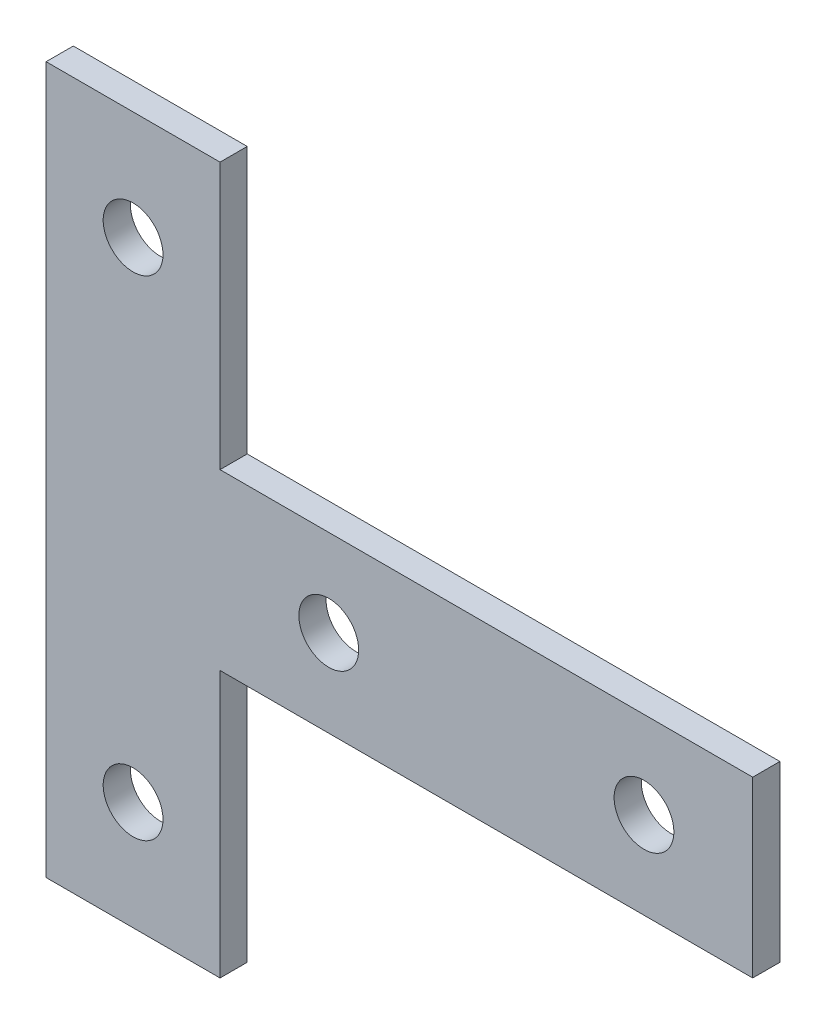
ISO-10303-21;
HEADER;
FILE_DESCRIPTION(('STEP AP214'),'2;1');
FILE_NAME('part.step','',(''),(''),'','','');
FILE_SCHEMA(('AUTOMOTIVE_DESIGN { 1 0 10303 214 1 1 1 1 }'));
ENDSEC;
DATA;
#1=APPLICATION_CONTEXT('core data for automotive mechanical design processes');
#2=APPLICATION_PROTOCOL_DEFINITION('international standard','automotive_design',2000,#1);
#3=PRODUCT_CONTEXT('',#1,'mechanical');
#4=PRODUCT('Part','Part','',(#3));
#5=PRODUCT_RELATED_PRODUCT_CATEGORY('part','',(#4));
#6=PRODUCT_DEFINITION_FORMATION('','',#4);
#7=PRODUCT_DEFINITION_CONTEXT('part definition',#1,'design');
#8=PRODUCT_DEFINITION('design','',#6,#7);
#9=PRODUCT_DEFINITION_SHAPE('','',#8);
#10=(LENGTH_UNIT() NAMED_UNIT(*) SI_UNIT(.MILLI.,.METRE.));
#11=(NAMED_UNIT(*) PLANE_ANGLE_UNIT() SI_UNIT($,.RADIAN.));
#12=(NAMED_UNIT(*) SI_UNIT($,.STERADIAN.) SOLID_ANGLE_UNIT());
#13=UNCERTAINTY_MEASURE_WITH_UNIT(LENGTH_MEASURE(1.E-05),#10,'distance_accuracy_value','');
#14=(GEOMETRIC_REPRESENTATION_CONTEXT(3) GLOBAL_UNCERTAINTY_ASSIGNED_CONTEXT((#13)) GLOBAL_UNIT_ASSIGNED_CONTEXT((#10,
#11,#12)) REPRESENTATION_CONTEXT('',''));
#15=CARTESIAN_POINT('',(0.,0.,0.));
#16=DIRECTION('',(0.,0.,1.));
#17=DIRECTION('',(1.,0.,0.));
#18=AXIS2_PLACEMENT_3D('',#15,#16,#17);
#19=CARTESIAN_POINT('',(0.,0.,2.5));
#20=DIRECTION('',(0.,0.,1.));
#21=DIRECTION('',(1.,0.,0.));
#22=AXIS2_PLACEMENT_3D('',#19,#20,#21);
#23=PLANE('',#22);
#24=CARTESIAN_POINT('',(-14.3167297303139,0.0308345227830586,2.5));
#25=DIRECTION('',(0.,0.,1.));
#26=DIRECTION('',(1.,0.,0.));
#27=AXIS2_PLACEMENT_3D('',#24,#25,#26);
#28=CIRCLE('',#27,2.75);
#29=CARTESIAN_POINT('',(-11.5667297303139,0.0308345227830586,2.5));
#30=VERTEX_POINT('',#29);
#31=EDGE_CURVE('E190',#30,#30,#28,.T.);
#32=ORIENTED_EDGE('',*,*,#31,.F.);
#33=EDGE_LOOP('',(#32));
#34=FACE_BOUND('',#33,.T.);
#35=CARTESIAN_POINT('',(32.6832702696861,22.5308345227831,2.5));
#36=DIRECTION('',(0.,0.,1.));
#37=DIRECTION('',(1.,0.,0.));
#38=AXIS2_PLACEMENT_3D('',#35,#36,#37);
#39=CIRCLE('',#38,2.75);
#40=CARTESIAN_POINT('',(35.4332702696861,22.5308345227831,2.5));
#41=VERTEX_POINT('',#40);
#42=EDGE_CURVE('E136',#41,#41,#39,.T.);
#43=ORIENTED_EDGE('',*,*,#42,.F.);
#44=EDGE_LOOP('',(#43));
#45=FACE_BOUND('',#44,.T.);
#46=DIRECTION('',(-1.,0.,0.));
#47=VECTOR('',#46,1.);
#48=CARTESIAN_POINT('',(-6.31672973031387,55.0308345227831,2.5));
#49=LINE('',#48,#47);
#50=CARTESIAN_POINT('',(-6.31672973031387,55.0308345227831,2.5));
#51=VERTEX_POINT('',#50);
#52=CARTESIAN_POINT('',(-22.3167297303139,55.0308345227831,2.5));
#53=VERTEX_POINT('',#52);
#54=EDGE_CURVE('E147',#51,#53,#49,.T.);
#55=ORIENTED_EDGE('',*,*,#54,.T.);
#56=DIRECTION('',(0.,-1.,0.));
#57=VECTOR('',#56,1.);
#58=CARTESIAN_POINT('',(-22.3167297303139,55.0308345227831,2.5));
#59=LINE('',#58,#57);
#60=CARTESIAN_POINT('',(-22.3167297303139,-9.96916547721694,2.5));
#61=VERTEX_POINT('',#60);
#62=EDGE_CURVE('E95',#53,#61,#59,.T.);
#63=ORIENTED_EDGE('',*,*,#62,.T.);
#64=DIRECTION('',(1.,0.,0.));
#65=VECTOR('',#64,1.);
#66=CARTESIAN_POINT('',(-22.3167297303139,-9.96916547721694,2.5));
#67=LINE('',#66,#65);
#68=CARTESIAN_POINT('',(-6.31672973031387,-9.96916547721694,2.5));
#69=VERTEX_POINT('',#68);
#70=EDGE_CURVE('E162',#61,#69,#67,.T.);
#71=ORIENTED_EDGE('',*,*,#70,.T.);
#72=DIRECTION('',(0.,1.,0.));
#73=VECTOR('',#72,1.);
#74=CARTESIAN_POINT('',(-6.31672973031387,-9.96916547721694,2.5));
#75=LINE('',#74,#73);
#76=CARTESIAN_POINT('',(-6.31672973031387,14.5308345227831,2.5));
#77=VERTEX_POINT('',#76);
#78=EDGE_CURVE('E175',#69,#77,#75,.T.);
#79=ORIENTED_EDGE('',*,*,#78,.T.);
#80=DIRECTION('',(1.,0.,0.));
#81=VECTOR('',#80,1.);
#82=CARTESIAN_POINT('',(-6.31672973031387,14.5308345227831,2.5));
#83=LINE('',#82,#81);
#84=CARTESIAN_POINT('',(42.6832702696861,14.5308345227831,2.5));
#85=VERTEX_POINT('',#84);
#86=EDGE_CURVE('E114',#77,#85,#83,.T.);
#87=ORIENTED_EDGE('',*,*,#86,.T.);
#88=DIRECTION('',(0.,1.,0.));
#89=VECTOR('',#88,1.);
#90=CARTESIAN_POINT('',(42.6832702696861,14.5308345227831,2.5));
#91=LINE('',#90,#89);
#92=CARTESIAN_POINT('',(42.6832702696861,30.5308345227831,2.5));
#93=VERTEX_POINT('',#92);
#94=EDGE_CURVE('E108',#85,#93,#91,.T.);
#95=ORIENTED_EDGE('',*,*,#94,.T.);
#96=DIRECTION('',(-1.,0.,0.));
#97=VECTOR('',#96,1.);
#98=CARTESIAN_POINT('',(42.6832702696861,30.5308345227831,2.5));
#99=LINE('',#98,#97);
#100=CARTESIAN_POINT('',(-6.31672973031387,30.5308345227831,2.5));
#101=VERTEX_POINT('',#100);
#102=EDGE_CURVE('E112',#93,#101,#99,.T.);
#103=ORIENTED_EDGE('',*,*,#102,.T.);
#104=DIRECTION('',(0.,1.,0.));
#105=VECTOR('',#104,1.);
#106=CARTESIAN_POINT('',(-6.31672973031387,30.5308345227831,2.5));
#107=LINE('',#106,#105);
#108=EDGE_CURVE('E52',#101,#51,#107,.T.);
#109=ORIENTED_EDGE('',*,*,#108,.T.);
#110=EDGE_LOOP('',(#55,#63,#71,#79,#87,#95,#103,#109));
#111=FACE_BOUND('',#110,.T.);
#112=CARTESIAN_POINT('',(3.68327026968613,22.5308345227831,2.5));
#113=DIRECTION('',(0.,0.,1.));
#114=DIRECTION('',(1.,0.,0.));
#115=AXIS2_PLACEMENT_3D('',#112,#113,#114);
#116=CIRCLE('',#115,2.75);
#117=CARTESIAN_POINT('',(6.43327026968613,22.5308345227831,2.5));
#118=VERTEX_POINT('',#117);
#119=EDGE_CURVE('E184',#118,#118,#116,.T.);
#120=ORIENTED_EDGE('',*,*,#119,.F.);
#121=EDGE_LOOP('',(#120));
#122=FACE_BOUND('',#121,.T.);
#123=CARTESIAN_POINT('',(-14.3167297303139,45.0308345227831,2.5));
#124=DIRECTION('',(0.,0.,1.));
#125=DIRECTION('',(1.,0.,0.));
#126=AXIS2_PLACEMENT_3D('',#123,#124,#125);
#127=CIRCLE('',#126,2.75);
#128=CARTESIAN_POINT('',(-11.5667297303139,45.0308345227831,2.5));
#129=VERTEX_POINT('',#128);
#130=EDGE_CURVE('E196',#129,#129,#127,.T.);
#131=ORIENTED_EDGE('',*,*,#130,.F.);
#132=EDGE_LOOP('',(#131));
#133=FACE_BOUND('',#132,.T.);
#134=ADVANCED_FACE('F35',(#34,#45,#111,#122,#133),#23,.T.);
#135=CARTESIAN_POINT('',(0.,0.,0.));
#136=DIRECTION('',(0.,0.,1.));
#137=DIRECTION('',(1.,0.,0.));
#138=AXIS2_PLACEMENT_3D('',#135,#136,#137);
#139=PLANE('',#138);
#140=DIRECTION('',(-1.,0.,0.));
#141=VECTOR('',#140,1.);
#142=CARTESIAN_POINT('',(-6.31672973031387,55.0308345227831,0.));
#143=LINE('',#142,#141);
#144=CARTESIAN_POINT('',(-6.31672973031387,55.0308345227831,0.));
#145=VERTEX_POINT('',#144);
#146=CARTESIAN_POINT('',(-22.3167297303139,55.0308345227831,0.));
#147=VERTEX_POINT('',#146);
#148=EDGE_CURVE('E132',#145,#147,#143,.T.);
#149=ORIENTED_EDGE('',*,*,#148,.F.);
#150=DIRECTION('',(0.,1.,0.));
#151=VECTOR('',#150,1.);
#152=CARTESIAN_POINT('',(-6.31672973031387,30.5308345227831,0.));
#153=LINE('',#152,#151);
#154=CARTESIAN_POINT('',(-6.31672973031387,30.5308345227831,0.));
#155=VERTEX_POINT('',#154);
#156=EDGE_CURVE('E87',#155,#145,#153,.T.);
#157=ORIENTED_EDGE('',*,*,#156,.F.);
#158=DIRECTION('',(-1.,0.,0.));
#159=VECTOR('',#158,1.);
#160=CARTESIAN_POINT('',(42.6832702696861,30.5308345227831,0.));
#161=LINE('',#160,#159);
#162=CARTESIAN_POINT('',(42.6832702696861,30.5308345227831,0.));
#163=VERTEX_POINT('',#162);
#164=EDGE_CURVE('E81',#163,#155,#161,.T.);
#165=ORIENTED_EDGE('',*,*,#164,.F.);
#166=DIRECTION('',(0.,1.,0.));
#167=VECTOR('',#166,1.);
#168=CARTESIAN_POINT('',(42.6832702696861,14.5308345227831,0.));
#169=LINE('',#168,#167);
#170=CARTESIAN_POINT('',(42.6832702696861,14.5308345227831,0.));
#171=VERTEX_POINT('',#170);
#172=EDGE_CURVE('E122',#171,#163,#169,.T.);
#173=ORIENTED_EDGE('',*,*,#172,.F.);
#174=DIRECTION('',(1.,0.,0.));
#175=VECTOR('',#174,1.);
#176=CARTESIAN_POINT('',(-6.31672973031387,14.5308345227831,0.));
#177=LINE('',#176,#175);
#178=CARTESIAN_POINT('',(-6.31672973031387,14.5308345227831,0.));
#179=VERTEX_POINT('',#178);
#180=EDGE_CURVE('E142',#179,#171,#177,.T.);
#181=ORIENTED_EDGE('',*,*,#180,.F.);
#182=DIRECTION('',(0.,1.,0.));
#183=VECTOR('',#182,1.);
#184=CARTESIAN_POINT('',(-6.31672973031387,-9.96916547721694,0.));
#185=LINE('',#184,#183);
#186=CARTESIAN_POINT('',(-6.31672973031387,-9.96916547721694,0.));
#187=VERTEX_POINT('',#186);
#188=EDGE_CURVE('E140',#187,#179,#185,.T.);
#189=ORIENTED_EDGE('',*,*,#188,.F.);
#190=DIRECTION('',(1.,0.,0.));
#191=VECTOR('',#190,1.);
#192=CARTESIAN_POINT('',(-22.3167297303139,-9.96916547721694,0.));
#193=LINE('',#192,#191);
#194=CARTESIAN_POINT('',(-22.3167297303139,-9.96916547721694,0.));
#195=VERTEX_POINT('',#194);
#196=EDGE_CURVE('E138',#195,#187,#193,.T.);
#197=ORIENTED_EDGE('',*,*,#196,.F.);
#198=DIRECTION('',(0.,-1.,0.));
#199=VECTOR('',#198,1.);
#200=CARTESIAN_POINT('',(-22.3167297303139,55.0308345227831,0.));
#201=LINE('',#200,#199);
#202=EDGE_CURVE('E135',#147,#195,#201,.T.);
#203=ORIENTED_EDGE('',*,*,#202,.F.);
#204=EDGE_LOOP('',(#149,#157,#165,#173,#181,#189,#197,#203));
#205=FACE_BOUND('',#204,.T.);
#206=CARTESIAN_POINT('',(32.6832702696861,22.5308345227831,0.));
#207=DIRECTION('',(0.,0.,1.));
#208=DIRECTION('',(1.,0.,0.));
#209=AXIS2_PLACEMENT_3D('',#206,#207,#208);
#210=CIRCLE('',#209,2.75);
#211=CARTESIAN_POINT('',(35.4332702696861,22.5308345227831,0.));
#212=VERTEX_POINT('',#211);
#213=EDGE_CURVE('E181',#212,#212,#210,.T.);
#214=ORIENTED_EDGE('',*,*,#213,.T.);
#215=EDGE_LOOP('',(#214));
#216=FACE_BOUND('',#215,.T.);
#217=CARTESIAN_POINT('',(3.68327026968613,22.5308345227831,0.));
#218=DIRECTION('',(0.,0.,1.));
#219=DIRECTION('',(1.,0.,0.));
#220=AXIS2_PLACEMENT_3D('',#217,#218,#219);
#221=CIRCLE('',#220,2.75);
#222=CARTESIAN_POINT('',(6.43327026968613,22.5308345227831,0.));
#223=VERTEX_POINT('',#222);
#224=EDGE_CURVE('E187',#223,#223,#221,.T.);
#225=ORIENTED_EDGE('',*,*,#224,.T.);
#226=EDGE_LOOP('',(#225));
#227=FACE_BOUND('',#226,.T.);
#228=CARTESIAN_POINT('',(-14.3167297303139,0.0308345227830586,0.));
#229=DIRECTION('',(0.,0.,1.));
#230=DIRECTION('',(1.,0.,0.));
#231=AXIS2_PLACEMENT_3D('',#228,#229,#230);
#232=CIRCLE('',#231,2.75);
#233=CARTESIAN_POINT('',(-11.5667297303139,0.0308345227830586,0.));
#234=VERTEX_POINT('',#233);
#235=EDGE_CURVE('E193',#234,#234,#232,.T.);
#236=ORIENTED_EDGE('',*,*,#235,.T.);
#237=EDGE_LOOP('',(#236));
#238=FACE_BOUND('',#237,.T.);
#239=CARTESIAN_POINT('',(-14.3167297303139,45.0308345227831,0.));
#240=DIRECTION('',(0.,0.,1.));
#241=DIRECTION('',(1.,0.,0.));
#242=AXIS2_PLACEMENT_3D('',#239,#240,#241);
#243=CIRCLE('',#242,2.75);
#244=CARTESIAN_POINT('',(-11.5667297303139,45.0308345227831,0.));
#245=VERTEX_POINT('',#244);
#246=EDGE_CURVE('E199',#245,#245,#243,.T.);
#247=ORIENTED_EDGE('',*,*,#246,.T.);
#248=EDGE_LOOP('',(#247));
#249=FACE_BOUND('',#248,.T.);
#250=ADVANCED_FACE('F166',(#205,#216,#227,#238,#249),#139,.F.);
#251=CARTESIAN_POINT('',(-6.31672973031387,55.0308345227831,2.5));
#252=DIRECTION('',(0.,-1.,0.));
#253=DIRECTION('',(0.,0.,-1.));
#254=AXIS2_PLACEMENT_3D('',#251,#252,#253);
#255=PLANE('',#254);
#256=ORIENTED_EDGE('',*,*,#148,.T.);
#257=DIRECTION('',(0.,0.,-1.));
#258=VECTOR('',#257,1.);
#259=CARTESIAN_POINT('',(-22.3167297303139,55.0308345227831,2.5));
#260=LINE('',#259,#258);
#261=EDGE_CURVE('E11',#53,#147,#260,.T.);
#262=ORIENTED_EDGE('',*,*,#261,.F.);
#263=ORIENTED_EDGE('',*,*,#54,.F.);
#264=DIRECTION('',(0.,0.,-1.));
#265=VECTOR('',#264,1.);
#266=CARTESIAN_POINT('',(-6.31672973031387,55.0308345227831,2.5));
#267=LINE('',#266,#265);
#268=EDGE_CURVE('E128',#51,#145,#267,.T.);
#269=ORIENTED_EDGE('',*,*,#268,.T.);
#270=EDGE_LOOP('',(#256,#262,#263,#269));
#271=FACE_BOUND('',#270,.T.);
#272=ADVANCED_FACE('F37',(#271),#255,.F.);
#273=CARTESIAN_POINT('',(-22.3167297303139,55.0308345227831,2.5));
#274=DIRECTION('',(1.,0.,0.));
#275=DIRECTION('',(0.,1.,0.));
#276=AXIS2_PLACEMENT_3D('',#273,#274,#275);
#277=PLANE('',#276);
#278=ORIENTED_EDGE('',*,*,#202,.T.);
#279=DIRECTION('',(0.,0.,-1.));
#280=VECTOR('',#279,1.);
#281=CARTESIAN_POINT('',(-22.3167297303139,-9.96916547721694,2.5));
#282=LINE('',#281,#280);
#283=EDGE_CURVE('E44',#61,#195,#282,.T.);
#284=ORIENTED_EDGE('',*,*,#283,.F.);
#285=ORIENTED_EDGE('',*,*,#62,.F.);
#286=ORIENTED_EDGE('',*,*,#261,.T.);
#287=EDGE_LOOP('',(#278,#284,#285,#286));
#288=FACE_BOUND('',#287,.T.);
#289=ADVANCED_FACE('F233',(#288),#277,.F.);
#290=CARTESIAN_POINT('',(-22.3167297303139,-9.96916547721694,2.5));
#291=DIRECTION('',(0.,1.,0.));
#292=DIRECTION('',(0.,0.,1.));
#293=AXIS2_PLACEMENT_3D('',#290,#291,#292);
#294=PLANE('',#293);
#295=ORIENTED_EDGE('',*,*,#196,.T.);
#296=DIRECTION('',(0.,0.,-1.));
#297=VECTOR('',#296,1.);
#298=CARTESIAN_POINT('',(-6.31672973031387,-9.96916547721694,2.5));
#299=LINE('',#298,#297);
#300=EDGE_CURVE('E154',#69,#187,#299,.T.);
#301=ORIENTED_EDGE('',*,*,#300,.F.);
#302=ORIENTED_EDGE('',*,*,#70,.F.);
#303=ORIENTED_EDGE('',*,*,#283,.T.);
#304=EDGE_LOOP('',(#295,#301,#302,#303));
#305=FACE_BOUND('',#304,.T.);
#306=ADVANCED_FACE('F160',(#305),#294,.F.);
#307=CARTESIAN_POINT('',(-6.31672973031387,-9.96916547721694,2.5));
#308=DIRECTION('',(-1.,0.,0.));
#309=DIRECTION('',(0.,0.,1.));
#310=AXIS2_PLACEMENT_3D('',#307,#308,#309);
#311=PLANE('',#310);
#312=ORIENTED_EDGE('',*,*,#188,.T.);
#313=DIRECTION('',(0.,0.,-1.));
#314=VECTOR('',#313,1.);
#315=CARTESIAN_POINT('',(-6.31672973031387,14.5308345227831,2.5));
#316=LINE('',#315,#314);
#317=EDGE_CURVE('E151',#77,#179,#316,.T.);
#318=ORIENTED_EDGE('',*,*,#317,.F.);
#319=ORIENTED_EDGE('',*,*,#78,.F.);
#320=ORIENTED_EDGE('',*,*,#300,.T.);
#321=EDGE_LOOP('',(#312,#318,#319,#320));
#322=FACE_BOUND('',#321,.T.);
#323=ADVANCED_FACE('F171',(#322),#311,.F.);
#324=CARTESIAN_POINT('',(-6.31672973031387,14.5308345227831,2.5));
#325=DIRECTION('',(0.,1.,0.));
#326=DIRECTION('',(0.,0.,1.));
#327=AXIS2_PLACEMENT_3D('',#324,#325,#326);
#328=PLANE('',#327);
#329=ORIENTED_EDGE('',*,*,#180,.T.);
#330=DIRECTION('',(0.,0.,-1.));
#331=VECTOR('',#330,1.);
#332=CARTESIAN_POINT('',(42.6832702696861,14.5308345227831,2.5));
#333=LINE('',#332,#331);
#334=EDGE_CURVE('E123',#85,#171,#333,.T.);
#335=ORIENTED_EDGE('',*,*,#334,.F.);
#336=ORIENTED_EDGE('',*,*,#86,.F.);
#337=ORIENTED_EDGE('',*,*,#317,.T.);
#338=EDGE_LOOP('',(#329,#335,#336,#337));
#339=FACE_BOUND('',#338,.T.);
#340=ADVANCED_FACE('F174',(#339),#328,.F.);
#341=CARTESIAN_POINT('',(42.6832702696861,14.5308345227831,2.5));
#342=DIRECTION('',(-1.,0.,0.));
#343=DIRECTION('',(0.,0.,1.));
#344=AXIS2_PLACEMENT_3D('',#341,#342,#343);
#345=PLANE('',#344);
#346=ORIENTED_EDGE('',*,*,#172,.T.);
#347=DIRECTION('',(0.,0.,-1.));
#348=VECTOR('',#347,1.);
#349=CARTESIAN_POINT('',(42.6832702696861,30.5308345227831,2.5));
#350=LINE('',#349,#348);
#351=EDGE_CURVE('E119',#93,#163,#350,.T.);
#352=ORIENTED_EDGE('',*,*,#351,.F.);
#353=ORIENTED_EDGE('',*,*,#94,.F.);
#354=ORIENTED_EDGE('',*,*,#334,.T.);
#355=EDGE_LOOP('',(#346,#352,#353,#354));
#356=FACE_BOUND('',#355,.T.);
#357=ADVANCED_FACE('F120',(#356),#345,.F.);
#358=CARTESIAN_POINT('',(42.6832702696861,30.5308345227831,2.5));
#359=DIRECTION('',(0.,-1.,0.));
#360=DIRECTION('',(0.,0.,-1.));
#361=AXIS2_PLACEMENT_3D('',#358,#359,#360);
#362=PLANE('',#361);
#363=ORIENTED_EDGE('',*,*,#164,.T.);
#364=DIRECTION('',(0.,0.,-1.));
#365=VECTOR('',#364,1.);
#366=CARTESIAN_POINT('',(-6.31672973031387,30.5308345227831,2.5));
#367=LINE('',#366,#365);
#368=EDGE_CURVE('E124',#101,#155,#367,.T.);
#369=ORIENTED_EDGE('',*,*,#368,.F.);
#370=ORIENTED_EDGE('',*,*,#102,.F.);
#371=ORIENTED_EDGE('',*,*,#351,.T.);
#372=EDGE_LOOP('',(#363,#369,#370,#371));
#373=FACE_BOUND('',#372,.T.);
#374=ADVANCED_FACE('F126',(#373),#362,.F.);
#375=CARTESIAN_POINT('',(-6.31672973031387,30.5308345227831,2.5));
#376=DIRECTION('',(-1.,0.,0.));
#377=DIRECTION('',(0.,0.,1.));
#378=AXIS2_PLACEMENT_3D('',#375,#376,#377);
#379=PLANE('',#378);
#380=ORIENTED_EDGE('',*,*,#156,.T.);
#381=ORIENTED_EDGE('',*,*,#268,.F.);
#382=ORIENTED_EDGE('',*,*,#108,.F.);
#383=ORIENTED_EDGE('',*,*,#368,.T.);
#384=EDGE_LOOP('',(#380,#381,#382,#383));
#385=FACE_BOUND('',#384,.T.);
#386=ADVANCED_FACE('F221',(#385),#379,.F.);
#387=CARTESIAN_POINT('',(32.6832702696861,22.5308345227831,2.5));
#388=DIRECTION('',(0.,0.,-1.));
#389=DIRECTION('',(-1.,0.,0.));
#390=AXIS2_PLACEMENT_3D('',#387,#388,#389);
#391=CYLINDRICAL_SURFACE('',#390,2.75);
#392=ORIENTED_EDGE('',*,*,#42,.T.);
#393=EDGE_LOOP('',(#392));
#394=FACE_BOUND('',#393,.T.);
#395=ORIENTED_EDGE('',*,*,#213,.F.);
#396=EDGE_LOOP('',(#395));
#397=FACE_BOUND('',#396,.T.);
#398=ADVANCED_FACE('F218',(#394,#397),#391,.F.);
#399=CARTESIAN_POINT('',(3.68327026968613,22.5308345227831,2.5));
#400=DIRECTION('',(0.,0.,-1.));
#401=DIRECTION('',(-1.,0.,0.));
#402=AXIS2_PLACEMENT_3D('',#399,#400,#401);
#403=CYLINDRICAL_SURFACE('',#402,2.75);
#404=ORIENTED_EDGE('',*,*,#119,.T.);
#405=EDGE_LOOP('',(#404));
#406=FACE_BOUND('',#405,.T.);
#407=ORIENTED_EDGE('',*,*,#224,.F.);
#408=EDGE_LOOP('',(#407));
#409=FACE_BOUND('',#408,.T.);
#410=ADVANCED_FACE('F297',(#406,#409),#403,.F.);
#411=CARTESIAN_POINT('',(-14.3167297303139,0.0308345227830586,2.5));
#412=DIRECTION('',(0.,0.,-1.));
#413=DIRECTION('',(-1.,0.,0.));
#414=AXIS2_PLACEMENT_3D('',#411,#412,#413);
#415=CYLINDRICAL_SURFACE('',#414,2.75);
#416=ORIENTED_EDGE('',*,*,#31,.T.);
#417=EDGE_LOOP('',(#416));
#418=FACE_BOUND('',#417,.T.);
#419=ORIENTED_EDGE('',*,*,#235,.F.);
#420=EDGE_LOOP('',(#419));
#421=FACE_BOUND('',#420,.T.);
#422=ADVANCED_FACE('F305',(#418,#421),#415,.F.);
#423=CARTESIAN_POINT('',(-14.3167297303139,45.0308345227831,2.5));
#424=DIRECTION('',(0.,0.,-1.));
#425=DIRECTION('',(-1.,0.,0.));
#426=AXIS2_PLACEMENT_3D('',#423,#424,#425);
#427=CYLINDRICAL_SURFACE('',#426,2.75);
#428=ORIENTED_EDGE('',*,*,#130,.T.);
#429=EDGE_LOOP('',(#428));
#430=FACE_BOUND('',#429,.T.);
#431=ORIENTED_EDGE('',*,*,#246,.F.);
#432=EDGE_LOOP('',(#431));
#433=FACE_BOUND('',#432,.T.);
#434=ADVANCED_FACE('F205',(#430,#433),#427,.F.);
#435=CLOSED_SHELL('',(#134,#250,#272,#289,#306,#323,#340,#357,#374,#386,#398,#410,#422,#434));
#436=MANIFOLD_SOLID_BREP('B2',#435);
#437=ADVANCED_BREP_SHAPE_REPRESENTATION('',(#18,#436),#14);
#438=SHAPE_DEFINITION_REPRESENTATION(#9,#437);
ENDSEC;
END-ISO-10303-21;
